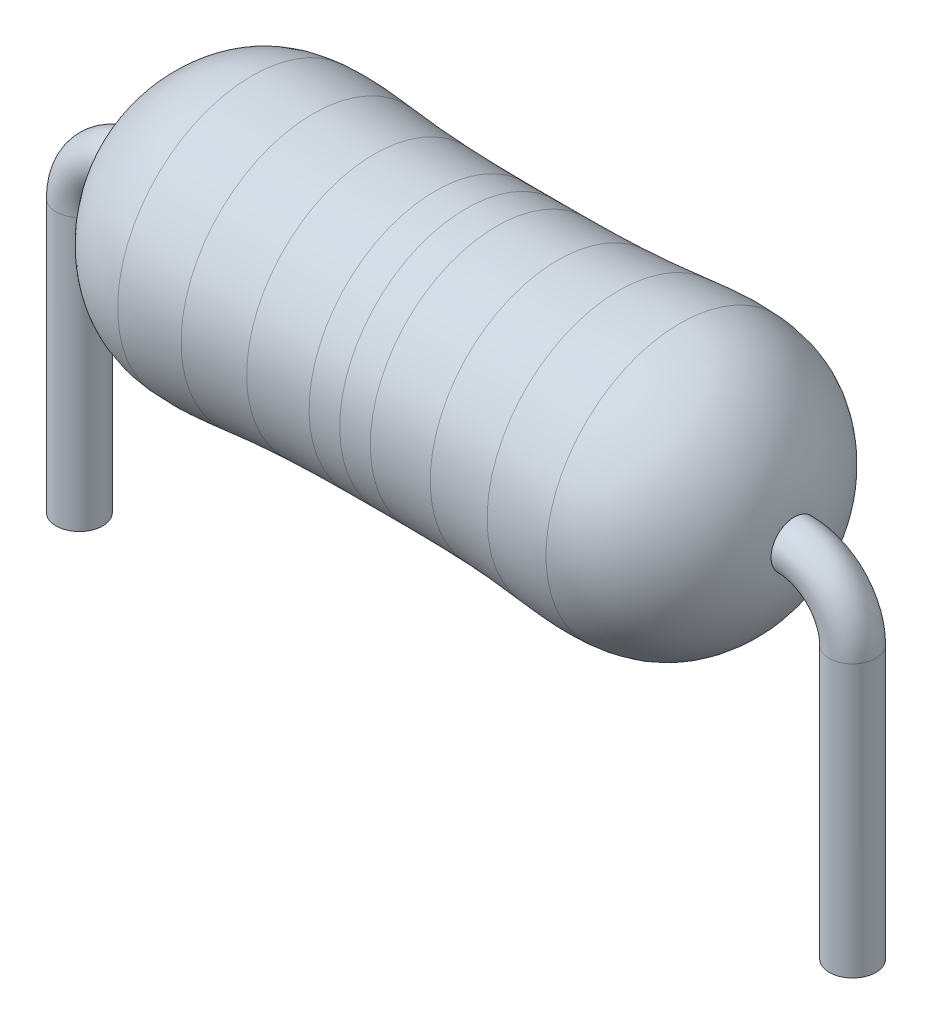
ISO-10303-21;
HEADER;
FILE_DESCRIPTION(('STEP AP214'),'2;1');
FILE_NAME('part.step','',(''),(''),'','','');
FILE_SCHEMA(('AUTOMOTIVE_DESIGN { 1 0 10303 214 1 1 1 1 }'));
ENDSEC;
DATA;
#1=APPLICATION_CONTEXT('core data for automotive mechanical design processes');
#2=APPLICATION_PROTOCOL_DEFINITION('international standard','automotive_design',2000,#1);
#3=PRODUCT_CONTEXT('',#1,'mechanical');
#4=PRODUCT('Part','Part','',(#3));
#5=PRODUCT_RELATED_PRODUCT_CATEGORY('part','',(#4));
#6=PRODUCT_DEFINITION_FORMATION('','',#4);
#7=PRODUCT_DEFINITION_CONTEXT('part definition',#1,'design');
#8=PRODUCT_DEFINITION('design','',#6,#7);
#9=PRODUCT_DEFINITION_SHAPE('','',#8);
#10=(LENGTH_UNIT() NAMED_UNIT(*) SI_UNIT(.MILLI.,.METRE.));
#11=(NAMED_UNIT(*) PLANE_ANGLE_UNIT() SI_UNIT($,.RADIAN.));
#12=(NAMED_UNIT(*) SI_UNIT($,.STERADIAN.) SOLID_ANGLE_UNIT());
#13=UNCERTAINTY_MEASURE_WITH_UNIT(LENGTH_MEASURE(1.E-05),#10,'distance_accuracy_value','');
#14=(GEOMETRIC_REPRESENTATION_CONTEXT(3) GLOBAL_UNCERTAINTY_ASSIGNED_CONTEXT((#13)) GLOBAL_UNIT_ASSIGNED_CONTEXT((#10,
#11,#12)) REPRESENTATION_CONTEXT('',''));
#15=CARTESIAN_POINT('',(0.,0.,0.));
#16=DIRECTION('',(0.,0.,1.));
#17=DIRECTION('',(1.,0.,0.));
#18=AXIS2_PLACEMENT_3D('',#15,#16,#17);
#19=CARTESIAN_POINT('',(0.762,1.778,0.));
#20=CARTESIAN_POINT('',(0.757798481162608,1.8794424331425,0.));
#21=CARTESIAN_POINT('',(0.731939999461414,2.50377553806516,0.));
#22=CARTESIAN_POINT('',(1.58171785802034,3.71232146915156,0.));
#23=CARTESIAN_POINT('',(3.36088257649651,3.42818239547803,0.));
#24=CARTESIAN_POINT('',(4.47917399306202,3.42872222585728,0.));
#25=CARTESIAN_POINT('',(5.0546,3.429,0.));
#26=B_SPLINE_CURVE_WITH_KNOTS('',3,(#19,#20,#21,#22,#23,#24,#25),.UNSPECIFIED.,.F.,.F.,(4,1,1,1,
4),(0.,0.0576904747940552,0.355059240367772,0.668140450217807,1.),.UNSPECIFIED.);
#27=CARTESIAN_POINT('',(0.762,1.778,0.));
#28=DIRECTION('',(-1.,0.,0.));
#29=AXIS1_PLACEMENT('',#27,#28);
#30=SURFACE_OF_REVOLUTION('',#26,#29);
#31=CARTESIAN_POINT('',(0.762,1.778,0.));
#32=DIRECTION('',(1.,0.,0.));
#33=DIRECTION('',(0.,0.,1.));
#34=AXIS2_PLACEMENT_3D('',#31,#32,#33);
#35=CIRCLE('',#34,0.3048);
#36=CARTESIAN_POINT('',(0.762,2.0828,0.));
#37=VERTEX_POINT('',#36);
#38=EDGE_CURVE('E75',#37,#37,#35,.T.);
#39=ORIENTED_EDGE('',*,*,#38,.T.);
#40=EDGE_LOOP('',(#39));
#41=FACE_BOUND('',#40,.T.);
#42=CARTESIAN_POINT('',(2.2546,1.778,0.));
#43=DIRECTION('',(-1.,0.,0.));
#44=DIRECTION('',(0.,-1.,0.));
#45=AXIS2_PLACEMENT_3D('',#42,#43,#44);
#46=CIRCLE('',#45,1.75368327505911);
#47=CARTESIAN_POINT('',(2.2546,0.0243167249408928,0.));
#48=VERTEX_POINT('',#47);
#49=EDGE_CURVE('E10',#48,#48,#46,.T.);
#50=ORIENTED_EDGE('',*,*,#49,.T.);
#51=EDGE_LOOP('',(#50));
#52=FACE_BOUND('',#51,.T.);
#53=ADVANCED_FACE('F49',(#41,#52),#30,.F.);
#54=CARTESIAN_POINT('',(3.8546,1.778,0.));
#55=DIRECTION('',(-1.,0.,0.));
#56=DIRECTION('',(0.,-1.,0.));
#57=AXIS2_PLACEMENT_3D('',#54,#55,#56);
#58=CIRCLE('',#57,1.66739616248276);
#59=CARTESIAN_POINT('',(3.8546,0.110603837517235,0.));
#60=VERTEX_POINT('',#59);
#61=EDGE_CURVE('E63',#60,#60,#58,.T.);
#62=ORIENTED_EDGE('',*,*,#61,.T.);
#63=EDGE_LOOP('',(#62));
#64=FACE_BOUND('',#63,.T.);
#65=CARTESIAN_POINT('',(3.0546,1.778,0.));
#66=DIRECTION('',(-1.,0.,0.));
#67=DIRECTION('',(0.,-1.,0.));
#68=AXIS2_PLACEMENT_3D('',#65,#66,#67);
#69=CIRCLE('',#68,1.72453972160211);
#70=CARTESIAN_POINT('',(3.0546,0.0534602783978902,0.));
#71=VERTEX_POINT('',#70);
#72=EDGE_CURVE('E57',#71,#71,#69,.F.);
#73=ORIENTED_EDGE('',*,*,#72,.T.);
#74=EDGE_LOOP('',(#73));
#75=FACE_BOUND('',#74,.T.);
#76=ADVANCED_FACE('F120',(#64,#75),#30,.F.);
#77=ORIENTED_EDGE('',*,*,#49,.F.);
#78=EDGE_LOOP('',(#77));
#79=FACE_BOUND('',#78,.T.);
#80=ORIENTED_EDGE('',*,*,#72,.F.);
#81=EDGE_LOOP('',(#80));
#82=FACE_BOUND('',#81,.T.);
#83=ADVANCED_FACE('F125',(#79,#82),#30,.F.);
#84=CARTESIAN_POINT('',(5.0546,1.778,0.));
#85=DIRECTION('',(-1.,0.,0.));
#86=DIRECTION('',(0.,-1.,0.));
#87=AXIS2_PLACEMENT_3D('',#84,#85,#86);
#88=CIRCLE('',#87,1.651);
#89=CARTESIAN_POINT('',(5.0546,0.127,0.));
#90=VERTEX_POINT('',#89);
#91=EDGE_CURVE('E143',#90,#90,#88,.T.);
#92=ORIENTED_EDGE('',*,*,#91,.T.);
#93=EDGE_LOOP('',(#92));
#94=FACE_BOUND('',#93,.T.);
#95=CARTESIAN_POINT('',(4.6546,1.778,0.));
#96=DIRECTION('',(-1.,0.,0.));
#97=DIRECTION('',(0.,-1.,0.));
#98=AXIS2_PLACEMENT_3D('',#95,#96,#97);
#99=CIRCLE('',#98,1.65144785309043);
#100=CARTESIAN_POINT('',(4.6546,0.126552146909569,0.));
#101=VERTEX_POINT('',#100);
#102=EDGE_CURVE('E69',#101,#101,#99,.F.);
#103=ORIENTED_EDGE('',*,*,#102,.T.);
#104=EDGE_LOOP('',(#103));
#105=FACE_BOUND('',#104,.T.);
#106=ADVANCED_FACE('F104',(#94,#105),#30,.F.);
#107=CARTESIAN_POINT('',(0.762,1.016,0.));
#108=DIRECTION('',(0.,0.,-1.));
#109=DIRECTION('',(-1.,0.,0.));
#110=AXIS2_PLACEMENT_3D('',#107,#108,#109);
#111=TOROIDAL_SURFACE('',#110,0.762,0.3048);
#112=CARTESIAN_POINT('',(0.,1.016,0.));
#113=DIRECTION('',(0.,1.,0.));
#114=DIRECTION('',(0.,0.,1.));
#115=AXIS2_PLACEMENT_3D('',#112,#113,#114);
#116=CIRCLE('',#115,0.3048);
#117=CARTESIAN_POINT('',(-0.3048,1.016,0.));
#118=VERTEX_POINT('',#117);
#119=EDGE_CURVE('E79',#118,#118,#116,.T.);
#120=CARTESIAN_POINT('',(0.762,1.016,0.));
#121=DIRECTION('',(0.,0.,-1.));
#122=DIRECTION('',(-1.,0.,0.));
#123=AXIS2_PLACEMENT_3D('',#120,#121,#122);
#124=CIRCLE('',#123,1.0668);
#125=EDGE_CURVE('',#118,#37,#124,.T.);
#126=ORIENTED_EDGE('',*,*,#119,.T.);
#127=ORIENTED_EDGE('',*,*,#38,.F.);
#128=ORIENTED_EDGE('',*,*,#125,.T.);
#129=ORIENTED_EDGE('',*,*,#125,.F.);
#130=EDGE_LOOP('',(#126,#128,#127,#129));
#131=FACE_BOUND('',#130,.T.);
#132=ADVANCED_FACE('F51',(#131),#111,.T.);
#133=CARTESIAN_POINT('',(0.,1.016,0.));
#134=DIRECTION('',(0.,-1.,0.));
#135=DIRECTION('',(0.,0.,-1.));
#136=AXIS2_PLACEMENT_3D('',#133,#134,#135);
#137=CYLINDRICAL_SURFACE('',#136,0.3048);
#138=ORIENTED_EDGE('',*,*,#119,.F.);
#139=EDGE_LOOP('',(#138));
#140=FACE_BOUND('',#139,.T.);
#141=CARTESIAN_POINT('',(0.,-2.54,0.));
#142=DIRECTION('',(0.,1.,0.));
#143=DIRECTION('',(0.,0.,1.));
#144=AXIS2_PLACEMENT_3D('',#141,#142,#143);
#145=CIRCLE('',#144,0.3048);
#146=CARTESIAN_POINT('',(0.,-2.54,0.3048));
#147=VERTEX_POINT('',#146);
#148=EDGE_CURVE('E80',#147,#147,#145,.T.);
#149=ORIENTED_EDGE('',*,*,#148,.T.);
#150=EDGE_LOOP('',(#149));
#151=FACE_BOUND('',#150,.T.);
#152=ADVANCED_FACE('F108',(#140,#151),#137,.T.);
#153=CARTESIAN_POINT('',(0.,-2.54,0.));
#154=DIRECTION('',(0.,1.,0.));
#155=DIRECTION('',(0.,0.,1.));
#156=AXIS2_PLACEMENT_3D('',#153,#154,#155);
#157=PLANE('',#156);
#158=ORIENTED_EDGE('',*,*,#148,.F.);
#159=EDGE_LOOP('',(#158));
#160=FACE_BOUND('',#159,.T.);
#161=ADVANCED_FACE('F102',(#160),#157,.F.);
#162=ORIENTED_EDGE('',*,*,#61,.F.);
#163=EDGE_LOOP('',(#162));
#164=FACE_BOUND('',#163,.T.);
#165=ORIENTED_EDGE('',*,*,#102,.F.);
#166=EDGE_LOOP('',(#165));
#167=FACE_BOUND('',#166,.T.);
#168=ADVANCED_FACE('F97',(#164,#167),#30,.F.);
#169=CARTESIAN_POINT('',(9.3472,1.778,0.));
#170=CARTESIAN_POINT('',(9.35140151883739,1.8794424331425,0.));
#171=CARTESIAN_POINT('',(9.37726000053859,2.50377553806516,0.));
#172=CARTESIAN_POINT('',(8.52748214197966,3.71232146915156,0.));
#173=CARTESIAN_POINT('',(6.74831742350349,3.42818239547803,0.));
#174=CARTESIAN_POINT('',(5.63002600693798,3.42872222585728,0.));
#175=CARTESIAN_POINT('',(5.0546,3.429,0.));
#176=B_SPLINE_CURVE_WITH_KNOTS('',3,(#169,#170,#171,#172,#173,#174,#175),.UNSPECIFIED.,.F.,.F.,
(4,1,1,1,4),(0.,0.0576904747940552,0.355059240367772,0.668140450217807,1.),.UNSPECIFIED.);
#177=CARTESIAN_POINT('',(9.3472,1.778,0.));
#178=DIRECTION('',(1.,0.,0.));
#179=AXIS1_PLACEMENT('',#177,#178);
#180=SURFACE_OF_REVOLUTION('',#176,#179);
#181=CARTESIAN_POINT('',(9.3472,1.778,0.));
#182=DIRECTION('',(1.,0.,0.));
#183=DIRECTION('',(0.,0.,1.));
#184=AXIS2_PLACEMENT_3D('',#181,#182,#183);
#185=CIRCLE('',#184,0.3048);
#186=CARTESIAN_POINT('',(9.3472,2.0828,0.));
#187=VERTEX_POINT('',#186);
#188=EDGE_CURVE('E159',#187,#187,#185,.T.);
#189=ORIENTED_EDGE('',*,*,#188,.F.);
#190=EDGE_LOOP('',(#189));
#191=FACE_BOUND('',#190,.T.);
#192=CARTESIAN_POINT('',(7.8546,1.778,0.));
#193=DIRECTION('',(-1.,0.,0.));
#194=DIRECTION('',(0.,-1.,0.));
#195=AXIS2_PLACEMENT_3D('',#192,#193,#194);
#196=CIRCLE('',#195,1.75368327505911);
#197=CARTESIAN_POINT('',(7.8546,0.0243167249408935,0.));
#198=VERTEX_POINT('',#197);
#199=EDGE_CURVE('E84',#198,#198,#196,.T.);
#200=ORIENTED_EDGE('',*,*,#199,.F.);
#201=EDGE_LOOP('',(#200));
#202=FACE_BOUND('',#201,.T.);
#203=ADVANCED_FACE('F101',(#191,#202),#180,.F.);
#204=CARTESIAN_POINT('',(6.2546,1.778,0.));
#205=DIRECTION('',(-1.,0.,0.));
#206=DIRECTION('',(0.,-1.,0.));
#207=AXIS2_PLACEMENT_3D('',#204,#205,#206);
#208=CIRCLE('',#207,1.66739616248276);
#209=CARTESIAN_POINT('',(6.2546,0.110603837517235,0.));
#210=VERTEX_POINT('',#209);
#211=EDGE_CURVE('E168',#210,#210,#208,.T.);
#212=ORIENTED_EDGE('',*,*,#211,.F.);
#213=EDGE_LOOP('',(#212));
#214=FACE_BOUND('',#213,.T.);
#215=CARTESIAN_POINT('',(7.0546,1.778,0.));
#216=DIRECTION('',(-1.,0.,0.));
#217=DIRECTION('',(0.,-1.,0.));
#218=AXIS2_PLACEMENT_3D('',#215,#216,#217);
#219=CIRCLE('',#218,1.72453972160211);
#220=CARTESIAN_POINT('',(7.0546,0.0534602783978906,0.));
#221=VERTEX_POINT('',#220);
#222=EDGE_CURVE('E171',#221,#221,#219,.F.);
#223=ORIENTED_EDGE('',*,*,#222,.F.);
#224=EDGE_LOOP('',(#223));
#225=FACE_BOUND('',#224,.T.);
#226=ADVANCED_FACE('F185',(#214,#225),#180,.F.);
#227=ORIENTED_EDGE('',*,*,#199,.T.);
#228=EDGE_LOOP('',(#227));
#229=FACE_BOUND('',#228,.T.);
#230=ORIENTED_EDGE('',*,*,#222,.T.);
#231=EDGE_LOOP('',(#230));
#232=FACE_BOUND('',#231,.T.);
#233=ADVANCED_FACE('F182',(#229,#232),#180,.F.);
#234=ORIENTED_EDGE('',*,*,#91,.F.);
#235=EDGE_LOOP('',(#234));
#236=FACE_BOUND('',#235,.T.);
#237=CARTESIAN_POINT('',(5.4546,1.778,0.));
#238=DIRECTION('',(-1.,0.,0.));
#239=DIRECTION('',(0.,-1.,0.));
#240=AXIS2_PLACEMENT_3D('',#237,#238,#239);
#241=CIRCLE('',#240,1.65144785309043);
#242=CARTESIAN_POINT('',(5.4546,0.126552146909569,0.));
#243=VERTEX_POINT('',#242);
#244=EDGE_CURVE('E164',#243,#243,#241,.F.);
#245=ORIENTED_EDGE('',*,*,#244,.F.);
#246=EDGE_LOOP('',(#245));
#247=FACE_BOUND('',#246,.T.);
#248=ADVANCED_FACE('F198',(#236,#247),#180,.F.);
#249=CARTESIAN_POINT('',(9.3472,1.016,0.));
#250=DIRECTION('',(0.,0.,-1.));
#251=DIRECTION('',(1.,0.,0.));
#252=AXIS2_PLACEMENT_3D('',#249,#250,#251);
#253=TOROIDAL_SURFACE('',#252,0.762,0.3048);
#254=CARTESIAN_POINT('',(10.1092,1.016,0.));
#255=DIRECTION('',(0.,-1.,0.));
#256=DIRECTION('',(0.,0.,1.));
#257=AXIS2_PLACEMENT_3D('',#254,#255,#256);
#258=CIRCLE('',#257,0.3048);
#259=CARTESIAN_POINT('',(10.414,1.016,0.));
#260=VERTEX_POINT('',#259);
#261=EDGE_CURVE('E150',#260,#260,#258,.T.);
#262=CARTESIAN_POINT('',(9.3472,1.016,0.));
#263=DIRECTION('',(0.,0.,-1.));
#264=DIRECTION('',(1.,0.,0.));
#265=AXIS2_PLACEMENT_3D('',#262,#263,#264);
#266=CIRCLE('',#265,1.0668);
#267=EDGE_CURVE('',#187,#260,#266,.T.);
#268=ORIENTED_EDGE('',*,*,#188,.T.);
#269=ORIENTED_EDGE('',*,*,#261,.F.);
#270=ORIENTED_EDGE('',*,*,#267,.T.);
#271=ORIENTED_EDGE('',*,*,#267,.F.);
#272=EDGE_LOOP('',(#268,#270,#269,#271));
#273=FACE_BOUND('',#272,.T.);
#274=ADVANCED_FACE('F105',(#273),#253,.T.);
#275=CARTESIAN_POINT('',(10.1092,1.016,0.));
#276=DIRECTION('',(0.,-1.,0.));
#277=DIRECTION('',(0.,0.,-1.));
#278=AXIS2_PLACEMENT_3D('',#275,#276,#277);
#279=CYLINDRICAL_SURFACE('',#278,0.3048);
#280=ORIENTED_EDGE('',*,*,#261,.T.);
#281=EDGE_LOOP('',(#280));
#282=FACE_BOUND('',#281,.T.);
#283=CARTESIAN_POINT('',(10.1092,-2.54,0.));
#284=DIRECTION('',(0.,-1.,0.));
#285=DIRECTION('',(0.,0.,1.));
#286=AXIS2_PLACEMENT_3D('',#283,#284,#285);
#287=CIRCLE('',#286,0.3048);
#288=CARTESIAN_POINT('',(10.1092,-2.54,0.3048));
#289=VERTEX_POINT('',#288);
#290=EDGE_CURVE('E146',#289,#289,#287,.T.);
#291=ORIENTED_EDGE('',*,*,#290,.F.);
#292=EDGE_LOOP('',(#291));
#293=FACE_BOUND('',#292,.T.);
#294=ADVANCED_FACE('F203',(#282,#293),#279,.T.);
#295=CARTESIAN_POINT('',(10.1092,-2.54,0.));
#296=DIRECTION('',(0.,1.,0.));
#297=DIRECTION('',(0.,0.,1.));
#298=AXIS2_PLACEMENT_3D('',#295,#296,#297);
#299=PLANE('',#298);
#300=ORIENTED_EDGE('',*,*,#290,.T.);
#301=EDGE_LOOP('',(#300));
#302=FACE_BOUND('',#301,.T.);
#303=ADVANCED_FACE('F196',(#302),#299,.F.);
#304=ORIENTED_EDGE('',*,*,#211,.T.);
#305=EDGE_LOOP('',(#304));
#306=FACE_BOUND('',#305,.T.);
#307=ORIENTED_EDGE('',*,*,#244,.T.);
#308=EDGE_LOOP('',(#307));
#309=FACE_BOUND('',#308,.T.);
#310=ADVANCED_FACE('F188',(#306,#309),#180,.F.);
#311=CLOSED_SHELL('',(#53,#76,#83,#106,#132,#152,#161,#168,#203,#226,#233,#248,#274,#294,#303,#310));
#312=MANIFOLD_SOLID_BREP('B2',#311);
#313=ADVANCED_BREP_SHAPE_REPRESENTATION('',(#18,#312),#14);
#314=SHAPE_DEFINITION_REPRESENTATION(#9,#313);
ENDSEC;
END-ISO-10303-21;
